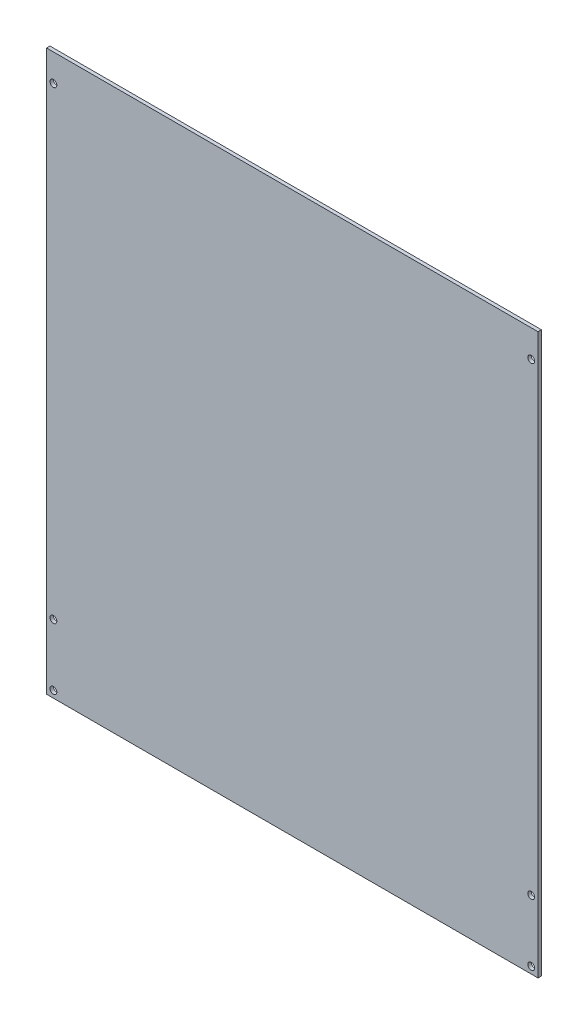
ISO-10303-21;
HEADER;
FILE_DESCRIPTION(('STEP AP214'),'2;1');
FILE_NAME('part.step','',(''),(''),'','','');
FILE_SCHEMA(('AUTOMOTIVE_DESIGN { 1 0 10303 214 1 1 1 1 }'));
ENDSEC;
DATA;
#1=APPLICATION_CONTEXT('core data for automotive mechanical design processes');
#2=APPLICATION_PROTOCOL_DEFINITION('international standard','automotive_design',2000,#1);
#3=PRODUCT_CONTEXT('',#1,'mechanical');
#4=PRODUCT('Part','Part','',(#3));
#5=PRODUCT_RELATED_PRODUCT_CATEGORY('part','',(#4));
#6=PRODUCT_DEFINITION_FORMATION('','',#4);
#7=PRODUCT_DEFINITION_CONTEXT('part definition',#1,'design');
#8=PRODUCT_DEFINITION('design','',#6,#7);
#9=PRODUCT_DEFINITION_SHAPE('','',#8);
#10=(LENGTH_UNIT() NAMED_UNIT(*) SI_UNIT(.MILLI.,.METRE.));
#11=(NAMED_UNIT(*) PLANE_ANGLE_UNIT() SI_UNIT($,.RADIAN.));
#12=(NAMED_UNIT(*) SI_UNIT($,.STERADIAN.) SOLID_ANGLE_UNIT());
#13=UNCERTAINTY_MEASURE_WITH_UNIT(LENGTH_MEASURE(1.E-05),#10,'distance_accuracy_value','');
#14=(GEOMETRIC_REPRESENTATION_CONTEXT(3) GLOBAL_UNCERTAINTY_ASSIGNED_CONTEXT((#13)) GLOBAL_UNIT_ASSIGNED_CONTEXT((#10,
#11,#12)) REPRESENTATION_CONTEXT('',''));
#15=CARTESIAN_POINT('',(0.,0.,0.));
#16=DIRECTION('',(0.,0.,1.));
#17=DIRECTION('',(1.,0.,0.));
#18=AXIS2_PLACEMENT_3D('',#15,#16,#17);
#19=CARTESIAN_POINT('',(228.6,-260.35,3.175));
#20=DIRECTION('',(-1.,0.,0.));
#21=DIRECTION('',(0.,0.,1.));
#22=AXIS2_PLACEMENT_3D('',#19,#20,#21);
#23=PLANE('',#22);
#24=DIRECTION('',(0.,1.,0.));
#25=VECTOR('',#24,1.);
#26=CARTESIAN_POINT('',(228.6,-260.35,0.));
#27=LINE('',#26,#25);
#28=CARTESIAN_POINT('',(228.6,-260.35,0.));
#29=VERTEX_POINT('',#28);
#30=CARTESIAN_POINT('',(228.6,260.35,0.));
#31=VERTEX_POINT('',#30);
#32=EDGE_CURVE('E96',#29,#31,#27,.T.);
#33=ORIENTED_EDGE('',*,*,#32,.T.);
#34=DIRECTION('',(0.,0.,-1.));
#35=VECTOR('',#34,1.);
#36=CARTESIAN_POINT('',(228.6,260.35,3.175));
#37=LINE('',#36,#35);
#38=CARTESIAN_POINT('',(228.6,260.35,3.175));
#39=VERTEX_POINT('',#38);
#40=EDGE_CURVE('E11',#39,#31,#37,.T.);
#41=ORIENTED_EDGE('',*,*,#40,.F.);
#42=DIRECTION('',(0.,1.,0.));
#43=VECTOR('',#42,1.);
#44=CARTESIAN_POINT('',(228.6,-260.35,3.175));
#45=LINE('',#44,#43);
#46=CARTESIAN_POINT('',(228.6,-260.35,3.175));
#47=VERTEX_POINT('',#46);
#48=EDGE_CURVE('E84',#47,#39,#45,.T.);
#49=ORIENTED_EDGE('',*,*,#48,.F.);
#50=DIRECTION('',(0.,0.,-1.));
#51=VECTOR('',#50,1.);
#52=CARTESIAN_POINT('',(228.6,-260.35,3.175));
#53=LINE('',#52,#51);
#54=EDGE_CURVE('E92',#47,#29,#53,.T.);
#55=ORIENTED_EDGE('',*,*,#54,.T.);
#56=EDGE_LOOP('',(#33,#41,#49,#55));
#57=FACE_BOUND('',#56,.T.);
#58=ADVANCED_FACE('F33',(#57),#23,.F.);
#59=CARTESIAN_POINT('',(-228.6,260.35,3.175));
#60=DIRECTION('',(0.,-1.,0.));
#61=DIRECTION('',(0.,0.,-1.));
#62=AXIS2_PLACEMENT_3D('',#59,#60,#61);
#63=PLANE('',#62);
#64=DIRECTION('',(-1.,0.,0.));
#65=VECTOR('',#64,1.);
#66=CARTESIAN_POINT('',(-228.6,260.35,0.));
#67=LINE('',#66,#65);
#68=CARTESIAN_POINT('',(-228.6,260.35,0.));
#69=VERTEX_POINT('',#68);
#70=EDGE_CURVE('E88',#31,#69,#67,.T.);
#71=ORIENTED_EDGE('',*,*,#70,.T.);
#72=DIRECTION('',(0.,0.,-1.));
#73=VECTOR('',#72,1.);
#74=CARTESIAN_POINT('',(-228.6,260.35,3.175));
#75=LINE('',#74,#73);
#76=CARTESIAN_POINT('',(-228.6,260.35,3.175));
#77=VERTEX_POINT('',#76);
#78=EDGE_CURVE('E41',#77,#69,#75,.T.);
#79=ORIENTED_EDGE('',*,*,#78,.F.);
#80=DIRECTION('',(-1.,0.,0.));
#81=VECTOR('',#80,1.);
#82=CARTESIAN_POINT('',(-228.6,260.35,3.175));
#83=LINE('',#82,#81);
#84=EDGE_CURVE('E79',#39,#77,#83,.T.);
#85=ORIENTED_EDGE('',*,*,#84,.F.);
#86=ORIENTED_EDGE('',*,*,#40,.T.);
#87=EDGE_LOOP('',(#71,#79,#85,#86));
#88=FACE_BOUND('',#87,.T.);
#89=ADVANCED_FACE('F87',(#88),#63,.F.);
#90=CARTESIAN_POINT('',(-228.6,-260.35,3.175));
#91=DIRECTION('',(1.,0.,0.));
#92=DIRECTION('',(0.,0.,-1.));
#93=AXIS2_PLACEMENT_3D('',#90,#91,#92);
#94=PLANE('',#93);
#95=DIRECTION('',(0.,-1.,0.));
#96=VECTOR('',#95,1.);
#97=CARTESIAN_POINT('',(-228.6,-260.35,0.));
#98=LINE('',#97,#96);
#99=CARTESIAN_POINT('',(-228.6,-260.35,0.));
#100=VERTEX_POINT('',#99);
#101=EDGE_CURVE('E66',#69,#100,#98,.T.);
#102=ORIENTED_EDGE('',*,*,#101,.T.);
#103=DIRECTION('',(0.,0.,-1.));
#104=VECTOR('',#103,1.);
#105=CARTESIAN_POINT('',(-228.6,-260.35,3.175));
#106=LINE('',#105,#104);
#107=CARTESIAN_POINT('',(-228.6,-260.35,3.175));
#108=VERTEX_POINT('',#107);
#109=EDGE_CURVE('E89',#108,#100,#106,.T.);
#110=ORIENTED_EDGE('',*,*,#109,.F.);
#111=DIRECTION('',(0.,-1.,0.));
#112=VECTOR('',#111,1.);
#113=CARTESIAN_POINT('',(-228.6,-260.35,3.175));
#114=LINE('',#113,#112);
#115=EDGE_CURVE('E82',#77,#108,#114,.T.);
#116=ORIENTED_EDGE('',*,*,#115,.F.);
#117=ORIENTED_EDGE('',*,*,#78,.T.);
#118=EDGE_LOOP('',(#102,#110,#116,#117));
#119=FACE_BOUND('',#118,.T.);
#120=ADVANCED_FACE('F90',(#119),#94,.F.);
#121=CARTESIAN_POINT('',(-228.6,-260.35,3.175));
#122=DIRECTION('',(0.,1.,0.));
#123=DIRECTION('',(0.,0.,1.));
#124=AXIS2_PLACEMENT_3D('',#121,#122,#123);
#125=PLANE('',#124);
#126=DIRECTION('',(1.,0.,0.));
#127=VECTOR('',#126,1.);
#128=CARTESIAN_POINT('',(-228.6,-260.35,0.));
#129=LINE('',#128,#127);
#130=EDGE_CURVE('E72',#100,#29,#129,.T.);
#131=ORIENTED_EDGE('',*,*,#130,.T.);
#132=ORIENTED_EDGE('',*,*,#54,.F.);
#133=DIRECTION('',(1.,0.,0.));
#134=VECTOR('',#133,1.);
#135=CARTESIAN_POINT('',(-228.6,-260.35,3.175));
#136=LINE('',#135,#134);
#137=EDGE_CURVE('E49',#108,#47,#136,.T.);
#138=ORIENTED_EDGE('',*,*,#137,.F.);
#139=ORIENTED_EDGE('',*,*,#109,.T.);
#140=EDGE_LOOP('',(#131,#132,#138,#139));
#141=FACE_BOUND('',#140,.T.);
#142=ADVANCED_FACE('F104',(#141),#125,.F.);
#143=CARTESIAN_POINT('',(0.,0.,3.175));
#144=DIRECTION('',(0.,0.,-1.));
#145=DIRECTION('',(-1.,0.,0.));
#146=AXIS2_PLACEMENT_3D('',#143,#144,#145);
#147=PLANE('',#146);
#148=CARTESIAN_POINT('',(-222.25,-196.85,3.175));
#149=DIRECTION('',(0.,0.,1.));
#150=DIRECTION('',(1.,0.,0.));
#151=AXIS2_PLACEMENT_3D('',#148,#149,#150);
#152=CIRCLE('',#151,3.17499999999997);
#153=CARTESIAN_POINT('',(-219.075,-196.85,3.175));
#154=VERTEX_POINT('',#153);
#155=EDGE_CURVE('E128',#154,#154,#152,.T.);
#156=ORIENTED_EDGE('',*,*,#155,.F.);
#157=EDGE_LOOP('',(#156));
#158=FACE_BOUND('',#157,.T.);
#159=CARTESIAN_POINT('',(222.25,-254.,3.175));
#160=DIRECTION('',(0.,0.,1.));
#161=DIRECTION('',(1.,0.,0.));
#162=AXIS2_PLACEMENT_3D('',#159,#160,#161);
#163=CIRCLE('',#162,3.175);
#164=CARTESIAN_POINT('',(225.425,-254.,3.175));
#165=VERTEX_POINT('',#164);
#166=EDGE_CURVE('E135',#165,#165,#163,.T.);
#167=ORIENTED_EDGE('',*,*,#166,.F.);
#168=EDGE_LOOP('',(#167));
#169=FACE_BOUND('',#168,.T.);
#170=CARTESIAN_POINT('',(-222.25,-254.,3.175));
#171=DIRECTION('',(0.,0.,1.));
#172=DIRECTION('',(1.,0.,0.));
#173=AXIS2_PLACEMENT_3D('',#170,#171,#172);
#174=CIRCLE('',#173,3.17499999999997);
#175=CARTESIAN_POINT('',(-219.075,-254.,3.175));
#176=VERTEX_POINT('',#175);
#177=EDGE_CURVE('E116',#176,#176,#174,.T.);
#178=ORIENTED_EDGE('',*,*,#177,.F.);
#179=EDGE_LOOP('',(#178));
#180=FACE_BOUND('',#179,.T.);
#181=CARTESIAN_POINT('',(222.25,234.95,3.175));
#182=DIRECTION('',(0.,0.,1.));
#183=DIRECTION('',(1.,0.,0.));
#184=AXIS2_PLACEMENT_3D('',#181,#182,#183);
#185=CIRCLE('',#184,3.17499999999997);
#186=CARTESIAN_POINT('',(225.425,234.95,3.175));
#187=VERTEX_POINT('',#186);
#188=EDGE_CURVE('E123',#187,#187,#185,.T.);
#189=ORIENTED_EDGE('',*,*,#188,.F.);
#190=EDGE_LOOP('',(#189));
#191=FACE_BOUND('',#190,.T.);
#192=CARTESIAN_POINT('',(222.25,-196.85,3.175));
#193=DIRECTION('',(0.,0.,1.));
#194=DIRECTION('',(1.,0.,0.));
#195=AXIS2_PLACEMENT_3D('',#192,#193,#194);
#196=CIRCLE('',#195,3.17499999999997);
#197=CARTESIAN_POINT('',(225.425,-196.85,3.175));
#198=VERTEX_POINT('',#197);
#199=EDGE_CURVE('E140',#198,#198,#196,.T.);
#200=ORIENTED_EDGE('',*,*,#199,.F.);
#201=EDGE_LOOP('',(#200));
#202=FACE_BOUND('',#201,.T.);
#203=CARTESIAN_POINT('',(-222.25,234.95,3.175));
#204=DIRECTION('',(0.,0.,1.));
#205=DIRECTION('',(1.,0.,0.));
#206=AXIS2_PLACEMENT_3D('',#203,#204,#205);
#207=CIRCLE('',#206,3.17499999999997);
#208=CARTESIAN_POINT('',(-219.075,234.95,3.175));
#209=VERTEX_POINT('',#208);
#210=EDGE_CURVE('E110',#209,#209,#207,.T.);
#211=ORIENTED_EDGE('',*,*,#210,.F.);
#212=EDGE_LOOP('',(#211));
#213=FACE_BOUND('',#212,.T.);
#214=ORIENTED_EDGE('',*,*,#48,.T.);
#215=ORIENTED_EDGE('',*,*,#84,.T.);
#216=ORIENTED_EDGE('',*,*,#115,.T.);
#217=ORIENTED_EDGE('',*,*,#137,.T.);
#218=EDGE_LOOP('',(#214,#215,#216,#217));
#219=FACE_BOUND('',#218,.T.);
#220=ADVANCED_FACE('F80',(#158,#169,#180,#191,#202,#213,#219),#147,.F.);
#221=CARTESIAN_POINT('',(0.,0.,0.));
#222=DIRECTION('',(0.,0.,-1.));
#223=DIRECTION('',(-1.,0.,0.));
#224=AXIS2_PLACEMENT_3D('',#221,#222,#223);
#225=PLANE('',#224);
#226=CARTESIAN_POINT('',(-222.25,-196.85,0.));
#227=DIRECTION('',(0.,0.,1.));
#228=DIRECTION('',(1.,0.,0.));
#229=AXIS2_PLACEMENT_3D('',#226,#227,#228);
#230=CIRCLE('',#229,3.17499999999997);
#231=CARTESIAN_POINT('',(-219.075,-196.85,0.));
#232=VERTEX_POINT('',#231);
#233=EDGE_CURVE('E131',#232,#232,#230,.T.);
#234=ORIENTED_EDGE('',*,*,#233,.T.);
#235=EDGE_LOOP('',(#234));
#236=FACE_BOUND('',#235,.T.);
#237=CARTESIAN_POINT('',(222.25,-254.,0.));
#238=DIRECTION('',(0.,0.,1.));
#239=DIRECTION('',(1.,0.,0.));
#240=AXIS2_PLACEMENT_3D('',#237,#238,#239);
#241=CIRCLE('',#240,3.175);
#242=CARTESIAN_POINT('',(225.425,-254.,0.));
#243=VERTEX_POINT('',#242);
#244=EDGE_CURVE('E120',#243,#243,#241,.T.);
#245=ORIENTED_EDGE('',*,*,#244,.T.);
#246=EDGE_LOOP('',(#245));
#247=FACE_BOUND('',#246,.T.);
#248=CARTESIAN_POINT('',(-222.25,-254.,0.));
#249=DIRECTION('',(0.,0.,1.));
#250=DIRECTION('',(1.,0.,0.));
#251=AXIS2_PLACEMENT_3D('',#248,#249,#250);
#252=CIRCLE('',#251,3.17499999999997);
#253=CARTESIAN_POINT('',(-219.075,-254.,0.));
#254=VERTEX_POINT('',#253);
#255=EDGE_CURVE('E119',#254,#254,#252,.T.);
#256=ORIENTED_EDGE('',*,*,#255,.T.);
#257=EDGE_LOOP('',(#256));
#258=FACE_BOUND('',#257,.T.);
#259=CARTESIAN_POINT('',(222.25,234.95,0.));
#260=DIRECTION('',(0.,0.,1.));
#261=DIRECTION('',(1.,0.,0.));
#262=AXIS2_PLACEMENT_3D('',#259,#260,#261);
#263=CIRCLE('',#262,3.17499999999997);
#264=CARTESIAN_POINT('',(225.425,234.95,0.));
#265=VERTEX_POINT('',#264);
#266=EDGE_CURVE('E113',#265,#265,#263,.T.);
#267=ORIENTED_EDGE('',*,*,#266,.T.);
#268=EDGE_LOOP('',(#267));
#269=FACE_BOUND('',#268,.T.);
#270=CARTESIAN_POINT('',(222.25,-196.85,0.));
#271=DIRECTION('',(0.,0.,1.));
#272=DIRECTION('',(1.,0.,0.));
#273=AXIS2_PLACEMENT_3D('',#270,#271,#272);
#274=CIRCLE('',#273,3.17499999999997);
#275=CARTESIAN_POINT('',(225.425,-196.85,0.));
#276=VERTEX_POINT('',#275);
#277=EDGE_CURVE('E132',#276,#276,#274,.T.);
#278=ORIENTED_EDGE('',*,*,#277,.T.);
#279=EDGE_LOOP('',(#278));
#280=FACE_BOUND('',#279,.T.);
#281=CARTESIAN_POINT('',(-222.25,234.95,0.));
#282=DIRECTION('',(0.,0.,1.));
#283=DIRECTION('',(1.,0.,0.));
#284=AXIS2_PLACEMENT_3D('',#281,#282,#283);
#285=CIRCLE('',#284,3.17499999999997);
#286=CARTESIAN_POINT('',(-219.075,234.95,0.));
#287=VERTEX_POINT('',#286);
#288=EDGE_CURVE('E99',#287,#287,#285,.T.);
#289=ORIENTED_EDGE('',*,*,#288,.T.);
#290=EDGE_LOOP('',(#289));
#291=FACE_BOUND('',#290,.T.);
#292=ORIENTED_EDGE('',*,*,#32,.F.);
#293=ORIENTED_EDGE('',*,*,#130,.F.);
#294=ORIENTED_EDGE('',*,*,#101,.F.);
#295=ORIENTED_EDGE('',*,*,#70,.F.);
#296=EDGE_LOOP('',(#292,#293,#294,#295));
#297=FACE_BOUND('',#296,.T.);
#298=ADVANCED_FACE('F107',(#236,#247,#258,#269,#280,#291,#297),#225,.T.);
#299=CARTESIAN_POINT('',(-222.25,234.95,0.));
#300=DIRECTION('',(0.,0.,1.));
#301=DIRECTION('',(1.,0.,0.));
#302=AXIS2_PLACEMENT_3D('',#299,#300,#301);
#303=CYLINDRICAL_SURFACE('',#302,3.17499999999997);
#304=ORIENTED_EDGE('',*,*,#288,.F.);
#305=EDGE_LOOP('',(#304));
#306=FACE_BOUND('',#305,.T.);
#307=ORIENTED_EDGE('',*,*,#210,.T.);
#308=EDGE_LOOP('',(#307));
#309=FACE_BOUND('',#308,.T.);
#310=ADVANCED_FACE('F152',(#306,#309),#303,.F.);
#311=CARTESIAN_POINT('',(222.25,-196.85,0.));
#312=DIRECTION('',(0.,0.,1.));
#313=DIRECTION('',(1.,0.,0.));
#314=AXIS2_PLACEMENT_3D('',#311,#312,#313);
#315=CYLINDRICAL_SURFACE('',#314,3.17499999999997);
#316=ORIENTED_EDGE('',*,*,#277,.F.);
#317=EDGE_LOOP('',(#316));
#318=FACE_BOUND('',#317,.T.);
#319=ORIENTED_EDGE('',*,*,#199,.T.);
#320=EDGE_LOOP('',(#319));
#321=FACE_BOUND('',#320,.T.);
#322=ADVANCED_FACE('F148',(#318,#321),#315,.F.);
#323=CARTESIAN_POINT('',(222.25,234.95,0.));
#324=DIRECTION('',(0.,0.,1.));
#325=DIRECTION('',(1.,0.,0.));
#326=AXIS2_PLACEMENT_3D('',#323,#324,#325);
#327=CYLINDRICAL_SURFACE('',#326,3.17499999999997);
#328=ORIENTED_EDGE('',*,*,#266,.F.);
#329=EDGE_LOOP('',(#328));
#330=FACE_BOUND('',#329,.T.);
#331=ORIENTED_EDGE('',*,*,#188,.T.);
#332=EDGE_LOOP('',(#331));
#333=FACE_BOUND('',#332,.T.);
#334=ADVANCED_FACE('F151',(#330,#333),#327,.F.);
#335=CARTESIAN_POINT('',(-222.25,-254.,0.));
#336=DIRECTION('',(0.,0.,1.));
#337=DIRECTION('',(1.,0.,0.));
#338=AXIS2_PLACEMENT_3D('',#335,#336,#337);
#339=CYLINDRICAL_SURFACE('',#338,3.17499999999997);
#340=ORIENTED_EDGE('',*,*,#255,.F.);
#341=EDGE_LOOP('',(#340));
#342=FACE_BOUND('',#341,.T.);
#343=ORIENTED_EDGE('',*,*,#177,.T.);
#344=EDGE_LOOP('',(#343));
#345=FACE_BOUND('',#344,.T.);
#346=ADVANCED_FACE('F213',(#342,#345),#339,.F.);
#347=CARTESIAN_POINT('',(222.25,-254.,0.));
#348=DIRECTION('',(0.,0.,1.));
#349=DIRECTION('',(1.,0.,0.));
#350=AXIS2_PLACEMENT_3D('',#347,#348,#349);
#351=CYLINDRICAL_SURFACE('',#350,3.175);
#352=ORIENTED_EDGE('',*,*,#244,.F.);
#353=EDGE_LOOP('',(#352));
#354=FACE_BOUND('',#353,.T.);
#355=ORIENTED_EDGE('',*,*,#166,.T.);
#356=EDGE_LOOP('',(#355));
#357=FACE_BOUND('',#356,.T.);
#358=ADVANCED_FACE('F223',(#354,#357),#351,.F.);
#359=CARTESIAN_POINT('',(-222.25,-196.85,0.));
#360=DIRECTION('',(0.,0.,1.));
#361=DIRECTION('',(1.,0.,0.));
#362=AXIS2_PLACEMENT_3D('',#359,#360,#361);
#363=CYLINDRICAL_SURFACE('',#362,3.17499999999997);
#364=ORIENTED_EDGE('',*,*,#233,.F.);
#365=EDGE_LOOP('',(#364));
#366=FACE_BOUND('',#365,.T.);
#367=ORIENTED_EDGE('',*,*,#155,.T.);
#368=EDGE_LOOP('',(#367));
#369=FACE_BOUND('',#368,.T.);
#370=ADVANCED_FACE('F232',(#366,#369),#363,.F.);
#371=CLOSED_SHELL('',(#58,#89,#120,#142,#220,#298,#310,#322,#334,#346,#358,#370));
#372=MANIFOLD_SOLID_BREP('B2',#371);
#373=ADVANCED_BREP_SHAPE_REPRESENTATION('',(#18,#372),#14);
#374=SHAPE_DEFINITION_REPRESENTATION(#9,#373);
ENDSEC;
END-ISO-10303-21;
